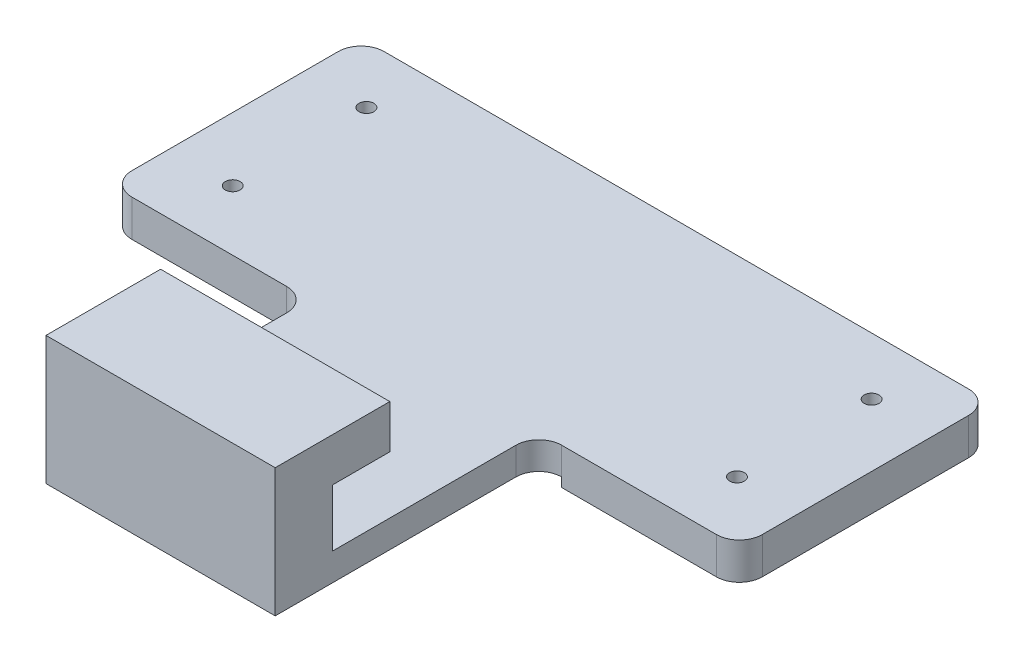
ISO-10303-21;
HEADER;
FILE_DESCRIPTION(('STEP AP214'),'2;1');
FILE_NAME('part.step','',(''),(''),'','','');
FILE_SCHEMA(('AUTOMOTIVE_DESIGN { 1 0 10303 214 1 1 1 1 }'));
ENDSEC;
DATA;
#1=APPLICATION_CONTEXT('core data for automotive mechanical design processes');
#2=APPLICATION_PROTOCOL_DEFINITION('international standard','automotive_design',2000,#1);
#3=PRODUCT_CONTEXT('',#1,'mechanical');
#4=PRODUCT('Part','Part','',(#3));
#5=PRODUCT_RELATED_PRODUCT_CATEGORY('part','',(#4));
#6=PRODUCT_DEFINITION_FORMATION('','',#4);
#7=PRODUCT_DEFINITION_CONTEXT('part definition',#1,'design');
#8=PRODUCT_DEFINITION('design','',#6,#7);
#9=PRODUCT_DEFINITION_SHAPE('','',#8);
#10=(LENGTH_UNIT() NAMED_UNIT(*) SI_UNIT(.MILLI.,.METRE.));
#11=(NAMED_UNIT(*) PLANE_ANGLE_UNIT() SI_UNIT($,.RADIAN.));
#12=(NAMED_UNIT(*) SI_UNIT($,.STERADIAN.) SOLID_ANGLE_UNIT());
#13=UNCERTAINTY_MEASURE_WITH_UNIT(LENGTH_MEASURE(1.E-05),#10,'distance_accuracy_value','');
#14=(GEOMETRIC_REPRESENTATION_CONTEXT(3) GLOBAL_UNCERTAINTY_ASSIGNED_CONTEXT((#13)) GLOBAL_UNIT_ASSIGNED_CONTEXT((#10,
#11,#12)) REPRESENTATION_CONTEXT('',''));
#15=CARTESIAN_POINT('',(0.,0.,0.));
#16=DIRECTION('',(0.,0.,1.));
#17=DIRECTION('',(1.,0.,0.));
#18=AXIS2_PLACEMENT_3D('',#15,#16,#17);
#19=CARTESIAN_POINT('',(-34.925,15.24,28.575));
#20=DIRECTION('',(0.,0.,-1.));
#21=DIRECTION('',(-1.,0.,0.));
#22=AXIS2_PLACEMENT_3D('',#19,#20,#21);
#23=PLANE('',#22);
#24=DIRECTION('',(1.,0.,0.));
#25=VECTOR('',#24,1.);
#26=CARTESIAN_POINT('',(-15.24,1.016,28.575));
#27=LINE('',#26,#25);
#28=CARTESIAN_POINT('',(-12.7,1.016,28.575));
#29=VERTEX_POINT('',#28);
#30=CARTESIAN_POINT('',(12.7,1.016,28.575));
#31=VERTEX_POINT('',#30);
#32=EDGE_CURVE('E366',#29,#31,#27,.T.);
#33=ORIENTED_EDGE('',*,*,#32,.T.);
#34=DIRECTION('',(0.,1.,0.));
#35=VECTOR('',#34,1.);
#36=CARTESIAN_POINT('',(12.7,0.,28.575));
#37=LINE('',#36,#35);
#38=CARTESIAN_POINT('',(12.7,15.24,28.575));
#39=VERTEX_POINT('',#38);
#40=EDGE_CURVE('E381',#31,#39,#37,.T.);
#41=ORIENTED_EDGE('',*,*,#40,.T.);
#42=DIRECTION('',(1.,0.,0.));
#43=VECTOR('',#42,1.);
#44=CARTESIAN_POINT('',(-34.925,15.24,28.575));
#45=LINE('',#44,#43);
#46=CARTESIAN_POINT('',(-12.7,15.24,28.575));
#47=VERTEX_POINT('',#46);
#48=EDGE_CURVE('E271',#47,#39,#45,.T.);
#49=ORIENTED_EDGE('',*,*,#48,.F.);
#50=DIRECTION('',(0.,1.,0.));
#51=VECTOR('',#50,1.);
#52=CARTESIAN_POINT('',(-12.7,0.,28.575));
#53=LINE('',#52,#51);
#54=EDGE_CURVE('E384',#29,#47,#53,.T.);
#55=ORIENTED_EDGE('',*,*,#54,.F.);
#56=EDGE_LOOP('',(#33,#41,#49,#55));
#57=FACE_BOUND('',#56,.T.);
#58=ADVANCED_FACE('F40',(#57),#23,.F.);
#59=CARTESIAN_POINT('',(0.,1.016,-4.76498919999999));
#60=DIRECTION('',(0.,0.,-1.));
#61=DIRECTION('',(-1.,0.,0.));
#62=AXIS2_PLACEMENT_3D('',#59,#60,#61);
#63=PLANE('',#62);
#64=DIRECTION('',(0.,-1.,0.));
#65=VECTOR('',#64,1.);
#66=CARTESIAN_POINT('',(-15.24,46.1888378548007,-4.76498919999999));
#67=LINE('',#66,#65);
#68=CARTESIAN_POINT('',(-15.24,1.016,-4.76498919999999));
#69=VERTEX_POINT('',#68);
#70=CARTESIAN_POINT('',(-15.24,0.,-4.76498919999999));
#71=VERTEX_POINT('',#70);
#72=EDGE_CURVE('E212',#69,#71,#67,.T.);
#73=ORIENTED_EDGE('',*,*,#72,.T.);
#74=DIRECTION('',(1.,0.,0.));
#75=VECTOR('',#74,1.);
#76=CARTESIAN_POINT('',(0.,0.,-4.76498919999999));
#77=LINE('',#76,#75);
#78=CARTESIAN_POINT('',(-30.861,0.,-4.76498919999999));
#79=VERTEX_POINT('',#78);
#80=EDGE_CURVE('E224',#79,#71,#77,.T.);
#81=ORIENTED_EDGE('',*,*,#80,.F.);
#82=DIRECTION('',(0.,-1.,0.));
#83=VECTOR('',#82,1.);
#84=CARTESIAN_POINT('',(-30.861,1.016,-4.76498919999999));
#85=LINE('',#84,#83);
#86=CARTESIAN_POINT('',(-30.861,1.016,-4.76498919999999));
#87=VERTEX_POINT('',#86);
#88=EDGE_CURVE('E250',#87,#79,#85,.T.);
#89=ORIENTED_EDGE('',*,*,#88,.F.);
#90=DIRECTION('',(1.,0.,0.));
#91=VECTOR('',#90,1.);
#92=CARTESIAN_POINT('',(0.,1.016,-4.76498919999999));
#93=LINE('',#92,#91);
#94=EDGE_CURVE('E227',#87,#69,#93,.T.);
#95=ORIENTED_EDGE('',*,*,#94,.T.);
#96=EDGE_LOOP('',(#73,#81,#89,#95));
#97=FACE_BOUND('',#96,.T.);
#98=ADVANCED_FACE('F223',(#97),#63,.T.);
#99=CARTESIAN_POINT('',(-12.7,0.,44.9679307917867));
#100=DIRECTION('',(1.,0.,0.));
#101=DIRECTION('',(0.,0.,-1.));
#102=AXIS2_PLACEMENT_3D('',#99,#100,#101);
#103=PLANE('',#102);
#104=DIRECTION('',(0.,0.,-1.));
#105=VECTOR('',#104,1.);
#106=CARTESIAN_POINT('',(-12.7,1.016,44.9679307917867));
#107=LINE('',#106,#105);
#108=CARTESIAN_POINT('',(-12.7,1.016,1.90500000000001));
#109=VERTEX_POINT('',#108);
#110=EDGE_CURVE('E54',#29,#109,#107,.T.);
#111=ORIENTED_EDGE('',*,*,#110,.F.);
#112=ORIENTED_EDGE('',*,*,#54,.T.);
#113=DIRECTION('',(0.,0.,-1.));
#114=VECTOR('',#113,1.);
#115=CARTESIAN_POINT('',(-12.7,15.24,44.9679307917867));
#116=LINE('',#115,#114);
#117=CARTESIAN_POINT('',(-12.7,15.24,15.875));
#118=VERTEX_POINT('',#117);
#119=EDGE_CURVE('E401',#47,#118,#116,.T.);
#120=ORIENTED_EDGE('',*,*,#119,.T.);
#121=DIRECTION('',(0.,-1.,0.));
#122=VECTOR('',#121,1.);
#123=CARTESIAN_POINT('',(-12.7,0.,15.875));
#124=LINE('',#123,#122);
#125=CARTESIAN_POINT('',(-12.7,10.414,15.875));
#126=VERTEX_POINT('',#125);
#127=EDGE_CURVE('E393',#118,#126,#124,.T.);
#128=ORIENTED_EDGE('',*,*,#127,.T.);
#129=DIRECTION('',(0.,0.,-1.));
#130=VECTOR('',#129,1.);
#131=CARTESIAN_POINT('',(-12.7,10.414,44.9679307917867));
#132=LINE('',#131,#130);
#133=CARTESIAN_POINT('',(-12.7,10.414,22.225));
#134=VERTEX_POINT('',#133);
#135=EDGE_CURVE('E405',#134,#126,#132,.T.);
#136=ORIENTED_EDGE('',*,*,#135,.F.);
#137=DIRECTION('',(0.,1.,0.));
#138=VECTOR('',#137,1.);
#139=CARTESIAN_POINT('',(-12.7,10.414,22.225));
#140=LINE('',#139,#138);
#141=CARTESIAN_POINT('',(-12.7,4.064,22.225));
#142=VERTEX_POINT('',#141);
#143=EDGE_CURVE('E362',#142,#134,#140,.T.);
#144=ORIENTED_EDGE('',*,*,#143,.F.);
#145=DIRECTION('',(0.,0.,1.));
#146=VECTOR('',#145,1.);
#147=CARTESIAN_POINT('',(-12.7,4.064,-28.575));
#148=LINE('',#147,#146);
#149=CARTESIAN_POINT('',(-12.7,4.064,1.90500000000001));
#150=VERTEX_POINT('',#149);
#151=EDGE_CURVE('E297',#150,#142,#148,.T.);
#152=ORIENTED_EDGE('',*,*,#151,.F.);
#153=DIRECTION('',(0.,1.,0.));
#154=VECTOR('',#153,1.);
#155=CARTESIAN_POINT('',(-12.7,0.,1.90500000000001));
#156=LINE('',#155,#154);
#157=EDGE_CURVE('E345',#150,#109,#156,.F.);
#158=ORIENTED_EDGE('',*,*,#157,.T.);
#159=EDGE_LOOP('',(#111,#112,#120,#128,#136,#144,#152,#158));
#160=FACE_BOUND('',#159,.T.);
#161=ADVANCED_FACE('F360',(#160),#103,.F.);
#162=CARTESIAN_POINT('',(12.7,0.,44.9679307917867));
#163=DIRECTION('',(1.,0.,0.));
#164=DIRECTION('',(0.,0.,-1.));
#165=AXIS2_PLACEMENT_3D('',#162,#163,#164);
#166=PLANE('',#165);
#167=ORIENTED_EDGE('',*,*,#40,.F.);
#168=DIRECTION('',(0.,0.,-1.));
#169=VECTOR('',#168,1.);
#170=CARTESIAN_POINT('',(12.7,1.016,44.9679307917867));
#171=LINE('',#170,#169);
#172=CARTESIAN_POINT('',(12.7,1.016,1.90500000000001));
#173=VERTEX_POINT('',#172);
#174=EDGE_CURVE('E378',#31,#173,#171,.T.);
#175=ORIENTED_EDGE('',*,*,#174,.T.);
#176=DIRECTION('',(0.,1.,0.));
#177=VECTOR('',#176,1.);
#178=CARTESIAN_POINT('',(12.7,0.,1.90500000000001));
#179=LINE('',#178,#177);
#180=CARTESIAN_POINT('',(12.7,4.064,1.90500000000001));
#181=VERTEX_POINT('',#180);
#182=EDGE_CURVE('E343',#173,#181,#179,.T.);
#183=ORIENTED_EDGE('',*,*,#182,.T.);
#184=DIRECTION('',(0.,0.,-1.));
#185=VECTOR('',#184,1.);
#186=CARTESIAN_POINT('',(12.7,4.064,-28.575));
#187=LINE('',#186,#185);
#188=CARTESIAN_POINT('',(12.7,4.064,22.225));
#189=VERTEX_POINT('',#188);
#190=EDGE_CURVE('E294',#189,#181,#187,.T.);
#191=ORIENTED_EDGE('',*,*,#190,.F.);
#192=DIRECTION('',(0.,-1.,0.));
#193=VECTOR('',#192,1.);
#194=CARTESIAN_POINT('',(12.7,10.414,22.225));
#195=LINE('',#194,#193);
#196=CARTESIAN_POINT('',(12.7,10.414,22.225));
#197=VERTEX_POINT('',#196);
#198=EDGE_CURVE('E387',#197,#189,#195,.T.);
#199=ORIENTED_EDGE('',*,*,#198,.F.);
#200=DIRECTION('',(0.,0.,-1.));
#201=VECTOR('',#200,1.);
#202=CARTESIAN_POINT('',(12.7,10.414,44.9679307917867));
#203=LINE('',#202,#201);
#204=CARTESIAN_POINT('',(12.7,10.414,15.875));
#205=VERTEX_POINT('',#204);
#206=EDGE_CURVE('E399',#197,#205,#203,.T.);
#207=ORIENTED_EDGE('',*,*,#206,.T.);
#208=DIRECTION('',(0.,-1.,0.));
#209=VECTOR('',#208,1.);
#210=CARTESIAN_POINT('',(12.7,0.,15.875));
#211=LINE('',#210,#209);
#212=CARTESIAN_POINT('',(12.7,15.24,15.875));
#213=VERTEX_POINT('',#212);
#214=EDGE_CURVE('E394',#213,#205,#211,.T.);
#215=ORIENTED_EDGE('',*,*,#214,.F.);
#216=DIRECTION('',(0.,0.,-1.));
#217=VECTOR('',#216,1.);
#218=CARTESIAN_POINT('',(12.7,15.24,44.9679307917867));
#219=LINE('',#218,#217);
#220=EDGE_CURVE('E398',#39,#213,#219,.T.);
#221=ORIENTED_EDGE('',*,*,#220,.F.);
#222=EDGE_LOOP('',(#167,#175,#183,#191,#199,#207,#215,#221));
#223=FACE_BOUND('',#222,.T.);
#224=ADVANCED_FACE('F466',(#223),#166,.T.);
#225=CARTESIAN_POINT('',(15.24,0.,1.90500000000001));
#226=DIRECTION('',(0.,1.,0.));
#227=DIRECTION('',(0.,0.,1.));
#228=AXIS2_PLACEMENT_3D('',#225,#226,#227);
#229=CYLINDRICAL_SURFACE('',#228,2.54);
#230=CARTESIAN_POINT('',(15.24,1.016,1.90500000000001));
#231=DIRECTION('',(0.,-1.,0.));
#232=DIRECTION('',(0.,0.,-1.));
#233=AXIS2_PLACEMENT_3D('',#230,#231,#232);
#234=CIRCLE('',#233,2.54);
#235=CARTESIAN_POINT('',(15.24,1.016,-0.634999999999989));
#236=VERTEX_POINT('',#235);
#237=EDGE_CURVE('E368',#236,#173,#234,.F.);
#238=ORIENTED_EDGE('',*,*,#237,.F.);
#239=DIRECTION('',(0.,1.,0.));
#240=VECTOR('',#239,1.);
#241=CARTESIAN_POINT('',(15.24,0.,-0.634999999999984));
#242=LINE('',#241,#240);
#243=CARTESIAN_POINT('',(15.24,4.064,-0.634999999999985));
#244=VERTEX_POINT('',#243);
#245=EDGE_CURVE('E337',#244,#236,#242,.F.);
#246=ORIENTED_EDGE('',*,*,#245,.F.);
#247=CARTESIAN_POINT('',(15.24,4.064,1.90500000000001));
#248=DIRECTION('',(0.,-1.,0.));
#249=DIRECTION('',(0.,0.,-1.));
#250=AXIS2_PLACEMENT_3D('',#247,#248,#249);
#251=CIRCLE('',#250,2.54);
#252=EDGE_CURVE('E348',#181,#244,#251,.T.);
#253=ORIENTED_EDGE('',*,*,#252,.F.);
#254=ORIENTED_EDGE('',*,*,#182,.F.);
#255=EDGE_LOOP('',(#238,#246,#253,#254));
#256=FACE_BOUND('',#255,.T.);
#257=ADVANCED_FACE('F456',(#256),#229,.F.);
#258=CARTESIAN_POINT('',(-15.24,0.,1.90500000000001));
#259=DIRECTION('',(0.,-1.,0.));
#260=DIRECTION('',(0.,0.,-1.));
#261=AXIS2_PLACEMENT_3D('',#258,#259,#260);
#262=CYLINDRICAL_SURFACE('',#261,2.54);
#263=CARTESIAN_POINT('',(-15.24,1.016,1.90500000000001));
#264=DIRECTION('',(0.,-1.,0.));
#265=DIRECTION('',(0.,0.,-1.));
#266=AXIS2_PLACEMENT_3D('',#263,#264,#265);
#267=CIRCLE('',#266,2.54);
#268=CARTESIAN_POINT('',(-15.24,1.016,-0.634999999999987));
#269=VERTEX_POINT('',#268);
#270=EDGE_CURVE('E12',#109,#269,#267,.F.);
#271=ORIENTED_EDGE('',*,*,#270,.F.);
#272=ORIENTED_EDGE('',*,*,#157,.F.);
#273=CARTESIAN_POINT('',(-15.24,4.064,1.90500000000001));
#274=DIRECTION('',(0.,-1.,0.));
#275=DIRECTION('',(0.,0.,-1.));
#276=AXIS2_PLACEMENT_3D('',#273,#274,#275);
#277=CIRCLE('',#276,2.54);
#278=CARTESIAN_POINT('',(-15.24,4.064,-0.634999999999986));
#279=VERTEX_POINT('',#278);
#280=EDGE_CURVE('E48',#279,#150,#277,.T.);
#281=ORIENTED_EDGE('',*,*,#280,.F.);
#282=DIRECTION('',(0.,1.,0.));
#283=VECTOR('',#282,1.);
#284=CARTESIAN_POINT('',(-15.24,4.064,-0.634999999999986));
#285=LINE('',#284,#283);
#286=EDGE_CURVE('E316',#269,#279,#285,.T.);
#287=ORIENTED_EDGE('',*,*,#286,.F.);
#288=EDGE_LOOP('',(#271,#272,#281,#287));
#289=FACE_BOUND('',#288,.T.);
#290=ADVANCED_FACE('F42',(#289),#262,.F.);
#291=CARTESIAN_POINT('',(15.875,15.24,15.875));
#292=DIRECTION('',(0.,0.,1.));
#293=DIRECTION('',(1.,0.,0.));
#294=AXIS2_PLACEMENT_3D('',#291,#292,#293);
#295=PLANE('',#294);
#296=ORIENTED_EDGE('',*,*,#214,.T.);
#297=DIRECTION('',(-1.,0.,0.));
#298=VECTOR('',#297,1.);
#299=CARTESIAN_POINT('',(34.925,10.414,15.875));
#300=LINE('',#299,#298);
#301=EDGE_CURVE('E409',#205,#126,#300,.T.);
#302=ORIENTED_EDGE('',*,*,#301,.T.);
#303=ORIENTED_EDGE('',*,*,#127,.F.);
#304=DIRECTION('',(-1.,0.,0.));
#305=VECTOR('',#304,1.);
#306=CARTESIAN_POINT('',(15.875,15.24,15.875));
#307=LINE('',#306,#305);
#308=EDGE_CURVE('E247',#213,#118,#307,.T.);
#309=ORIENTED_EDGE('',*,*,#308,.F.);
#310=EDGE_LOOP('',(#296,#302,#303,#309));
#311=FACE_BOUND('',#310,.T.);
#312=ADVANCED_FACE('F477',(#311),#295,.F.);
#313=CARTESIAN_POINT('',(34.925,10.414,15.875));
#314=DIRECTION('',(0.,1.,0.));
#315=DIRECTION('',(0.,0.,1.));
#316=AXIS2_PLACEMENT_3D('',#313,#314,#315);
#317=PLANE('',#316);
#318=ORIENTED_EDGE('',*,*,#206,.F.);
#319=DIRECTION('',(-1.,0.,0.));
#320=VECTOR('',#319,1.);
#321=CARTESIAN_POINT('',(34.925,10.414,22.225));
#322=LINE('',#321,#320);
#323=EDGE_CURVE('E397',#197,#134,#322,.T.);
#324=ORIENTED_EDGE('',*,*,#323,.T.);
#325=ORIENTED_EDGE('',*,*,#135,.T.);
#326=ORIENTED_EDGE('',*,*,#301,.F.);
#327=EDGE_LOOP('',(#318,#324,#325,#326));
#328=FACE_BOUND('',#327,.T.);
#329=ADVANCED_FACE('F472',(#328),#317,.F.);
#330=CARTESIAN_POINT('',(86.1203367016958,10.414,22.225));
#331=DIRECTION('',(0.,0.,1.));
#332=DIRECTION('',(1.,0.,0.));
#333=AXIS2_PLACEMENT_3D('',#330,#331,#332);
#334=PLANE('',#333);
#335=DIRECTION('',(-1.,0.,0.));
#336=VECTOR('',#335,1.);
#337=CARTESIAN_POINT('',(86.1203367016958,4.064,22.225));
#338=LINE('',#337,#336);
#339=EDGE_CURVE('E262',#189,#142,#338,.T.);
#340=ORIENTED_EDGE('',*,*,#339,.T.);
#341=ORIENTED_EDGE('',*,*,#143,.T.);
#342=ORIENTED_EDGE('',*,*,#323,.F.);
#343=ORIENTED_EDGE('',*,*,#198,.T.);
#344=EDGE_LOOP('',(#340,#341,#342,#343));
#345=FACE_BOUND('',#344,.T.);
#346=ADVANCED_FACE('F470',(#345),#334,.F.);
#347=CARTESIAN_POINT('',(0.,0.,0.));
#348=DIRECTION('',(0.,-1.,0.));
#349=DIRECTION('',(0.,0.,-1.));
#350=AXIS2_PLACEMENT_3D('',#347,#348,#349);
#351=PLANE('',#350);
#352=DIRECTION('',(0.,0.,-1.));
#353=VECTOR('',#352,1.);
#354=CARTESIAN_POINT('',(-15.24,0.,28.575));
#355=LINE('',#354,#353);
#356=CARTESIAN_POINT('',(-15.24,0.,-0.634999999999987));
#357=VERTEX_POINT('',#356);
#358=EDGE_CURVE('E208',#357,#71,#355,.T.);
#359=ORIENTED_EDGE('',*,*,#358,.F.);
#360=DIRECTION('',(-1.,0.,0.));
#361=VECTOR('',#360,1.);
#362=CARTESIAN_POINT('',(-34.925,0.,-0.634999999999986));
#363=LINE('',#362,#361);
#364=CARTESIAN_POINT('',(-32.385,0.,-0.634999999999986));
#365=VERTEX_POINT('',#364);
#366=EDGE_CURVE('E382',#357,#365,#363,.T.);
#367=ORIENTED_EDGE('',*,*,#366,.T.);
#368=CARTESIAN_POINT('',(-32.385,0.,-3.17499999999998));
#369=DIRECTION('',(0.,-1.,0.));
#370=DIRECTION('',(0.,0.,-1.));
#371=AXIS2_PLACEMENT_3D('',#368,#369,#370);
#372=CIRCLE('',#371,2.54);
#373=CARTESIAN_POINT('',(-34.925,0.,-3.17499999999998));
#374=VERTEX_POINT('',#373);
#375=EDGE_CURVE('E325',#365,#374,#372,.T.);
#376=ORIENTED_EDGE('',*,*,#375,.T.);
#377=DIRECTION('',(0.,0.,1.));
#378=VECTOR('',#377,1.);
#379=CARTESIAN_POINT('',(-34.925,0.,28.575));
#380=LINE('',#379,#378);
#381=CARTESIAN_POINT('',(-34.925,0.,-26.035));
#382=VERTEX_POINT('',#381);
#383=EDGE_CURVE('E275',#382,#374,#380,.T.);
#384=ORIENTED_EDGE('',*,*,#383,.F.);
#385=CARTESIAN_POINT('',(-32.385,0.,-26.035));
#386=DIRECTION('',(0.,-1.,0.));
#387=DIRECTION('',(0.,0.,-1.));
#388=AXIS2_PLACEMENT_3D('',#385,#386,#387);
#389=CIRCLE('',#388,2.54);
#390=CARTESIAN_POINT('',(-32.385,0.,-28.575));
#391=VERTEX_POINT('',#390);
#392=EDGE_CURVE('E323',#382,#391,#389,.T.);
#393=ORIENTED_EDGE('',*,*,#392,.T.);
#394=DIRECTION('',(-1.,0.,0.));
#395=VECTOR('',#394,1.);
#396=CARTESIAN_POINT('',(-34.925,0.,-28.575));
#397=LINE('',#396,#395);
#398=CARTESIAN_POINT('',(32.385,0.,-28.575));
#399=VERTEX_POINT('',#398);
#400=EDGE_CURVE('E278',#399,#391,#397,.T.);
#401=ORIENTED_EDGE('',*,*,#400,.F.);
#402=CARTESIAN_POINT('',(32.385,0.,-26.035));
#403=DIRECTION('',(0.,-1.,0.));
#404=DIRECTION('',(0.,0.,-1.));
#405=AXIS2_PLACEMENT_3D('',#402,#403,#404);
#406=CIRCLE('',#405,2.54);
#407=CARTESIAN_POINT('',(34.925,0.,-26.035));
#408=VERTEX_POINT('',#407);
#409=EDGE_CURVE('E321',#399,#408,#406,.T.);
#410=ORIENTED_EDGE('',*,*,#409,.T.);
#411=DIRECTION('',(0.,0.,-1.));
#412=VECTOR('',#411,1.);
#413=CARTESIAN_POINT('',(34.925,0.,28.575));
#414=LINE('',#413,#412);
#415=CARTESIAN_POINT('',(34.925,0.,-3.17499999999998));
#416=VERTEX_POINT('',#415);
#417=EDGE_CURVE('E270',#416,#408,#414,.T.);
#418=ORIENTED_EDGE('',*,*,#417,.F.);
#419=CARTESIAN_POINT('',(32.385,0.,-3.17499999999999));
#420=DIRECTION('',(0.,-1.,0.));
#421=DIRECTION('',(0.,0.,-1.));
#422=AXIS2_PLACEMENT_3D('',#419,#420,#421);
#423=CIRCLE('',#422,2.54);
#424=CARTESIAN_POINT('',(32.385,0.,-0.634999999999986));
#425=VERTEX_POINT('',#424);
#426=EDGE_CURVE('E62',#416,#425,#423,.T.);
#427=ORIENTED_EDGE('',*,*,#426,.T.);
#428=DIRECTION('',(-1.,0.,0.));
#429=VECTOR('',#428,1.);
#430=CARTESIAN_POINT('',(34.925,0.,-0.634999999999986));
#431=LINE('',#430,#429);
#432=CARTESIAN_POINT('',(15.24,0.,-0.634999999999989));
#433=VERTEX_POINT('',#432);
#434=EDGE_CURVE('E385',#425,#433,#431,.T.);
#435=ORIENTED_EDGE('',*,*,#434,.T.);
#436=DIRECTION('',(0.,0.,1.));
#437=VECTOR('',#436,1.);
#438=CARTESIAN_POINT('',(15.24,0.,28.575));
#439=LINE('',#438,#437);
#440=CARTESIAN_POINT('',(15.24,0.,-4.76498919999999));
#441=VERTEX_POINT('',#440);
#442=EDGE_CURVE('E219',#441,#433,#439,.T.);
#443=ORIENTED_EDGE('',*,*,#442,.F.);
#444=CARTESIAN_POINT('',(30.861,0.,-4.76498919999999));
#445=VERTEX_POINT('',#444);
#446=EDGE_CURVE('E234',#441,#445,#77,.T.);
#447=ORIENTED_EDGE('',*,*,#446,.T.);
#448=DIRECTION('',(0.,0.,-1.));
#449=VECTOR('',#448,1.);
#450=CARTESIAN_POINT('',(30.861,0.,0.));
#451=LINE('',#450,#449);
#452=CARTESIAN_POINT('',(30.861,0.,-24.765));
#453=VERTEX_POINT('',#452);
#454=EDGE_CURVE('E238',#445,#453,#451,.T.);
#455=ORIENTED_EDGE('',*,*,#454,.T.);
#456=DIRECTION('',(1.,0.,0.));
#457=VECTOR('',#456,1.);
#458=CARTESIAN_POINT('',(0.,0.,-24.765));
#459=LINE('',#458,#457);
#460=CARTESIAN_POINT('',(-30.861,0.,-24.765));
#461=VERTEX_POINT('',#460);
#462=EDGE_CURVE('E236',#461,#453,#459,.T.);
#463=ORIENTED_EDGE('',*,*,#462,.F.);
#464=DIRECTION('',(0.,0.,-1.));
#465=VECTOR('',#464,1.);
#466=CARTESIAN_POINT('',(-30.861,0.,0.));
#467=LINE('',#466,#465);
#468=EDGE_CURVE('E233',#79,#461,#467,.T.);
#469=ORIENTED_EDGE('',*,*,#468,.F.);
#470=ORIENTED_EDGE('',*,*,#80,.T.);
#471=EDGE_LOOP('',(#359,#367,#376,#384,#393,#401,#410,#418,#427,#435,#443,#447,#455,#463,#469,#470));
#472=FACE_BOUND('',#471,.T.);
#473=ADVANCED_FACE('F230',(#472),#351,.T.);
#474=CARTESIAN_POINT('',(34.925,15.24,28.575));
#475=DIRECTION('',(-1.,0.,0.));
#476=DIRECTION('',(0.,0.,1.));
#477=AXIS2_PLACEMENT_3D('',#474,#475,#476);
#478=PLANE('',#477);
#479=ORIENTED_EDGE('',*,*,#417,.T.);
#480=DIRECTION('',(0.,-1.,0.));
#481=VECTOR('',#480,1.);
#482=CARTESIAN_POINT('',(34.925,15.24,-26.035));
#483=LINE('',#482,#481);
#484=CARTESIAN_POINT('',(34.925,4.064,-26.035));
#485=VERTEX_POINT('',#484);
#486=EDGE_CURVE('E334',#408,#485,#483,.F.);
#487=ORIENTED_EDGE('',*,*,#486,.T.);
#488=DIRECTION('',(0.,0.,-1.));
#489=VECTOR('',#488,1.);
#490=CARTESIAN_POINT('',(34.925,4.064,-28.575));
#491=LINE('',#490,#489);
#492=CARTESIAN_POINT('',(34.925,4.064,-3.17499999999999));
#493=VERTEX_POINT('',#492);
#494=EDGE_CURVE('E265',#493,#485,#491,.T.);
#495=ORIENTED_EDGE('',*,*,#494,.F.);
#496=DIRECTION('',(0.,1.,0.));
#497=VECTOR('',#496,1.);
#498=CARTESIAN_POINT('',(34.925,15.24,-3.17499999999998));
#499=LINE('',#498,#497);
#500=EDGE_CURVE('E332',#493,#416,#499,.F.);
#501=ORIENTED_EDGE('',*,*,#500,.T.);
#502=EDGE_LOOP('',(#479,#487,#495,#501));
#503=FACE_BOUND('',#502,.T.);
#504=ADVANCED_FACE('F502',(#503),#478,.F.);
#505=CARTESIAN_POINT('',(0.,15.24,0.));
#506=DIRECTION('',(0.,-1.,0.));
#507=DIRECTION('',(0.,0.,-1.));
#508=AXIS2_PLACEMENT_3D('',#505,#506,#507);
#509=PLANE('',#508);
#510=ORIENTED_EDGE('',*,*,#119,.F.);
#511=ORIENTED_EDGE('',*,*,#48,.T.);
#512=ORIENTED_EDGE('',*,*,#220,.T.);
#513=ORIENTED_EDGE('',*,*,#308,.T.);
#514=EDGE_LOOP('',(#510,#511,#512,#513));
#515=FACE_BOUND('',#514,.T.);
#516=ADVANCED_FACE('F481',(#515),#509,.F.);
#517=CARTESIAN_POINT('',(-34.925,15.24,-28.575));
#518=DIRECTION('',(0.,0.,1.));
#519=DIRECTION('',(1.,0.,0.));
#520=AXIS2_PLACEMENT_3D('',#517,#518,#519);
#521=PLANE('',#520);
#522=ORIENTED_EDGE('',*,*,#400,.T.);
#523=DIRECTION('',(0.,-1.,0.));
#524=VECTOR('',#523,1.);
#525=CARTESIAN_POINT('',(-32.385,15.24,-28.575));
#526=LINE('',#525,#524);
#527=CARTESIAN_POINT('',(-32.385,4.064,-28.575));
#528=VERTEX_POINT('',#527);
#529=EDGE_CURVE('E330',#391,#528,#526,.F.);
#530=ORIENTED_EDGE('',*,*,#529,.T.);
#531=DIRECTION('',(-1.,0.,0.));
#532=VECTOR('',#531,1.);
#533=CARTESIAN_POINT('',(86.1203367016958,4.064,-28.575));
#534=LINE('',#533,#532);
#535=CARTESIAN_POINT('',(32.385,4.064,-28.575));
#536=VERTEX_POINT('',#535);
#537=EDGE_CURVE('E261',#536,#528,#534,.T.);
#538=ORIENTED_EDGE('',*,*,#537,.F.);
#539=DIRECTION('',(0.,-1.,0.));
#540=VECTOR('',#539,1.);
#541=CARTESIAN_POINT('',(32.385,15.24,-28.575));
#542=LINE('',#541,#540);
#543=EDGE_CURVE('E327',#536,#399,#542,.T.);
#544=ORIENTED_EDGE('',*,*,#543,.T.);
#545=EDGE_LOOP('',(#522,#530,#538,#544));
#546=FACE_BOUND('',#545,.T.);
#547=ADVANCED_FACE('F497',(#546),#521,.F.);
#548=CARTESIAN_POINT('',(-34.925,15.24,28.575));
#549=DIRECTION('',(1.,0.,0.));
#550=DIRECTION('',(0.,0.,-1.));
#551=AXIS2_PLACEMENT_3D('',#548,#549,#550);
#552=PLANE('',#551);
#553=ORIENTED_EDGE('',*,*,#383,.T.);
#554=DIRECTION('',(0.,1.,0.));
#555=VECTOR('',#554,1.);
#556=CARTESIAN_POINT('',(-34.925,15.24,-3.17499999999998));
#557=LINE('',#556,#555);
#558=CARTESIAN_POINT('',(-34.925,4.064,-3.17499999999998));
#559=VERTEX_POINT('',#558);
#560=EDGE_CURVE('E305',#374,#559,#557,.T.);
#561=ORIENTED_EDGE('',*,*,#560,.T.);
#562=DIRECTION('',(0.,0.,1.));
#563=VECTOR('',#562,1.);
#564=CARTESIAN_POINT('',(-34.925,4.064,-28.575));
#565=LINE('',#564,#563);
#566=CARTESIAN_POINT('',(-34.925,4.064,-26.035));
#567=VERTEX_POINT('',#566);
#568=EDGE_CURVE('E258',#567,#559,#565,.T.);
#569=ORIENTED_EDGE('',*,*,#568,.F.);
#570=DIRECTION('',(0.,-1.,0.));
#571=VECTOR('',#570,1.);
#572=CARTESIAN_POINT('',(-34.925,15.24,-26.035));
#573=LINE('',#572,#571);
#574=EDGE_CURVE('E302',#567,#382,#573,.T.);
#575=ORIENTED_EDGE('',*,*,#574,.T.);
#576=EDGE_LOOP('',(#553,#561,#569,#575));
#577=FACE_BOUND('',#576,.T.);
#578=ADVANCED_FACE('F494',(#577),#552,.F.);
#579=CARTESIAN_POINT('',(86.1203367016958,4.064,-28.575));
#580=DIRECTION('',(0.,-1.,0.));
#581=DIRECTION('',(0.,0.,-1.));
#582=AXIS2_PLACEMENT_3D('',#579,#580,#581);
#583=PLANE('',#582);
#584=CARTESIAN_POINT('',(27.9908,4.064,-22.225));
#585=DIRECTION('',(0.,-1.,0.));
#586=DIRECTION('',(0.,0.,-1.));
#587=AXIS2_PLACEMENT_3D('',#584,#585,#586);
#588=CIRCLE('',#587,0.819150000000002);
#589=CARTESIAN_POINT('',(27.9908,4.064,-23.04415));
#590=VERTEX_POINT('',#589);
#591=EDGE_CURVE('E291',#590,#590,#588,.T.);
#592=ORIENTED_EDGE('',*,*,#591,.T.);
#593=EDGE_LOOP('',(#592));
#594=FACE_BOUND('',#593,.T.);
#595=CARTESIAN_POINT('',(-27.8892,4.064,-7.30498919999999));
#596=DIRECTION('',(0.,-1.,0.));
#597=DIRECTION('',(0.,0.,-1.));
#598=AXIS2_PLACEMENT_3D('',#595,#596,#597);
#599=CIRCLE('',#598,0.819149999999995);
#600=CARTESIAN_POINT('',(-27.8892,4.064,-8.12413919999998));
#601=VERTEX_POINT('',#600);
#602=EDGE_CURVE('E417',#601,#601,#599,.T.);
#603=ORIENTED_EDGE('',*,*,#602,.T.);
#604=EDGE_LOOP('',(#603));
#605=FACE_BOUND('',#604,.T.);
#606=CARTESIAN_POINT('',(27.9908,4.064,-7.30498919999999));
#607=DIRECTION('',(0.,-1.,0.));
#608=DIRECTION('',(0.,0.,-1.));
#609=AXIS2_PLACEMENT_3D('',#606,#607,#608);
#610=CIRCLE('',#609,0.819150000000002);
#611=CARTESIAN_POINT('',(27.9908,4.064,-8.12413919999999));
#612=VERTEX_POINT('',#611);
#613=EDGE_CURVE('E287',#612,#612,#610,.T.);
#614=ORIENTED_EDGE('',*,*,#613,.T.);
#615=EDGE_LOOP('',(#614));
#616=FACE_BOUND('',#615,.T.);
#617=CARTESIAN_POINT('',(-27.9908,4.064,-22.225));
#618=DIRECTION('',(0.,-1.,0.));
#619=DIRECTION('',(0.,0.,-1.));
#620=AXIS2_PLACEMENT_3D('',#617,#618,#619);
#621=CIRCLE('',#620,0.819150000000002);
#622=CARTESIAN_POINT('',(-27.9908,4.064,-23.04415));
#623=VERTEX_POINT('',#622);
#624=EDGE_CURVE('E286',#623,#623,#621,.T.);
#625=ORIENTED_EDGE('',*,*,#624,.T.);
#626=EDGE_LOOP('',(#625));
#627=FACE_BOUND('',#626,.T.);
#628=ORIENTED_EDGE('',*,*,#568,.T.);
#629=CARTESIAN_POINT('',(-32.385,4.064,-3.17499999999998));
#630=DIRECTION('',(0.,-1.,0.));
#631=DIRECTION('',(0.,0.,-1.));
#632=AXIS2_PLACEMENT_3D('',#629,#630,#631);
#633=CIRCLE('',#632,2.54);
#634=CARTESIAN_POINT('',(-32.385,4.064,-0.634999999999986));
#635=VERTEX_POINT('',#634);
#636=EDGE_CURVE('E314',#559,#635,#633,.F.);
#637=ORIENTED_EDGE('',*,*,#636,.T.);
#638=DIRECTION('',(1.,0.,0.));
#639=VECTOR('',#638,1.);
#640=CARTESIAN_POINT('',(86.1203367016958,4.064,-0.634999999999986));
#641=LINE('',#640,#639);
#642=EDGE_CURVE('E299',#635,#279,#641,.T.);
#643=ORIENTED_EDGE('',*,*,#642,.T.);
#644=ORIENTED_EDGE('',*,*,#280,.T.);
#645=ORIENTED_EDGE('',*,*,#151,.T.);
#646=ORIENTED_EDGE('',*,*,#339,.F.);
#647=ORIENTED_EDGE('',*,*,#190,.T.);
#648=ORIENTED_EDGE('',*,*,#252,.T.);
#649=DIRECTION('',(1.,0.,0.));
#650=VECTOR('',#649,1.);
#651=CARTESIAN_POINT('',(86.1203367016958,4.064,-0.634999999999993));
#652=LINE('',#651,#650);
#653=CARTESIAN_POINT('',(32.385,4.064,-0.634999999999987));
#654=VERTEX_POINT('',#653);
#655=EDGE_CURVE('E274',#244,#654,#652,.T.);
#656=ORIENTED_EDGE('',*,*,#655,.T.);
#657=CARTESIAN_POINT('',(32.385,4.064,-3.17499999999999));
#658=DIRECTION('',(0.,-1.,0.));
#659=DIRECTION('',(0.,0.,-1.));
#660=AXIS2_PLACEMENT_3D('',#657,#658,#659);
#661=CIRCLE('',#660,2.54);
#662=EDGE_CURVE('E308',#654,#493,#661,.F.);
#663=ORIENTED_EDGE('',*,*,#662,.T.);
#664=ORIENTED_EDGE('',*,*,#494,.T.);
#665=CARTESIAN_POINT('',(32.385,4.064,-26.035));
#666=DIRECTION('',(0.,-1.,0.));
#667=DIRECTION('',(0.,0.,-1.));
#668=AXIS2_PLACEMENT_3D('',#665,#666,#667);
#669=CIRCLE('',#668,2.54);
#670=EDGE_CURVE('E310',#485,#536,#669,.F.);
#671=ORIENTED_EDGE('',*,*,#670,.T.);
#672=ORIENTED_EDGE('',*,*,#537,.T.);
#673=CARTESIAN_POINT('',(-32.385,4.064,-26.035));
#674=DIRECTION('',(0.,-1.,0.));
#675=DIRECTION('',(0.,0.,-1.));
#676=AXIS2_PLACEMENT_3D('',#673,#674,#675);
#677=CIRCLE('',#676,2.54);
#678=EDGE_CURVE('E312',#528,#567,#677,.F.);
#679=ORIENTED_EDGE('',*,*,#678,.T.);
#680=EDGE_LOOP('',(#628,#637,#643,#644,#645,#646,#647,#648,#656,#663,#664,#671,#672,#679));
#681=FACE_BOUND('',#680,.T.);
#682=ADVANCED_FACE('F352',(#594,#605,#616,#627,#681),#583,.F.);
#683=CARTESIAN_POINT('',(30.861,1.016,0.));
#684=DIRECTION('',(-1.,0.,0.));
#685=DIRECTION('',(0.,0.,1.));
#686=AXIS2_PLACEMENT_3D('',#683,#684,#685);
#687=PLANE('',#686);
#688=ORIENTED_EDGE('',*,*,#454,.F.);
#689=DIRECTION('',(0.,-1.,0.));
#690=VECTOR('',#689,1.);
#691=CARTESIAN_POINT('',(30.861,1.016,-4.76498919999999));
#692=LINE('',#691,#690);
#693=CARTESIAN_POINT('',(30.861,1.016,-4.76498919999999));
#694=VERTEX_POINT('',#693);
#695=EDGE_CURVE('E252',#694,#445,#692,.T.);
#696=ORIENTED_EDGE('',*,*,#695,.F.);
#697=DIRECTION('',(0.,0.,-1.));
#698=VECTOR('',#697,1.);
#699=CARTESIAN_POINT('',(30.861,1.016,0.));
#700=LINE('',#699,#698);
#701=CARTESIAN_POINT('',(30.861,1.016,-24.765));
#702=VERTEX_POINT('',#701);
#703=EDGE_CURVE('E244',#694,#702,#700,.T.);
#704=ORIENTED_EDGE('',*,*,#703,.T.);
#705=DIRECTION('',(0.,-1.,0.));
#706=VECTOR('',#705,1.);
#707=CARTESIAN_POINT('',(30.861,1.016,-24.765));
#708=LINE('',#707,#706);
#709=EDGE_CURVE('E245',#702,#453,#708,.T.);
#710=ORIENTED_EDGE('',*,*,#709,.T.);
#711=EDGE_LOOP('',(#688,#696,#704,#710));
#712=FACE_BOUND('',#711,.T.);
#713=ADVANCED_FACE('F444',(#712),#687,.T.);
#714=CARTESIAN_POINT('',(0.,1.016,-24.765));
#715=DIRECTION('',(0.,0.,-1.));
#716=DIRECTION('',(-1.,0.,0.));
#717=AXIS2_PLACEMENT_3D('',#714,#715,#716);
#718=PLANE('',#717);
#719=ORIENTED_EDGE('',*,*,#462,.T.);
#720=ORIENTED_EDGE('',*,*,#709,.F.);
#721=DIRECTION('',(1.,0.,0.));
#722=VECTOR('',#721,1.);
#723=CARTESIAN_POINT('',(0.,1.016,-24.765));
#724=LINE('',#723,#722);
#725=CARTESIAN_POINT('',(-30.861,1.016,-24.765));
#726=VERTEX_POINT('',#725);
#727=EDGE_CURVE('E255',#726,#702,#724,.T.);
#728=ORIENTED_EDGE('',*,*,#727,.F.);
#729=DIRECTION('',(0.,-1.,0.));
#730=VECTOR('',#729,1.);
#731=CARTESIAN_POINT('',(-30.861,1.016,-24.765));
#732=LINE('',#731,#730);
#733=EDGE_CURVE('E248',#726,#461,#732,.T.);
#734=ORIENTED_EDGE('',*,*,#733,.T.);
#735=EDGE_LOOP('',(#719,#720,#728,#734));
#736=FACE_BOUND('',#735,.T.);
#737=ADVANCED_FACE('F440',(#736),#718,.F.);
#738=CARTESIAN_POINT('',(-30.861,1.016,0.));
#739=DIRECTION('',(-1.,0.,0.));
#740=DIRECTION('',(0.,0.,1.));
#741=AXIS2_PLACEMENT_3D('',#738,#739,#740);
#742=PLANE('',#741);
#743=ORIENTED_EDGE('',*,*,#468,.T.);
#744=ORIENTED_EDGE('',*,*,#733,.F.);
#745=DIRECTION('',(0.,0.,-1.));
#746=VECTOR('',#745,1.);
#747=CARTESIAN_POINT('',(-30.861,1.016,0.));
#748=LINE('',#747,#746);
#749=EDGE_CURVE('E432',#87,#726,#748,.T.);
#750=ORIENTED_EDGE('',*,*,#749,.F.);
#751=ORIENTED_EDGE('',*,*,#88,.T.);
#752=EDGE_LOOP('',(#743,#744,#750,#751));
#753=FACE_BOUND('',#752,.T.);
#754=ADVANCED_FACE('F559',(#753),#742,.F.);
#755=DIRECTION('',(0.,-1.,0.));
#756=VECTOR('',#755,1.);
#757=CARTESIAN_POINT('',(15.24,46.1888378548007,-4.76498919999999));
#758=LINE('',#757,#756);
#759=CARTESIAN_POINT('',(15.24,1.016,-4.76498919999999));
#760=VERTEX_POINT('',#759);
#761=EDGE_CURVE('E228',#760,#441,#758,.T.);
#762=ORIENTED_EDGE('',*,*,#761,.F.);
#763=EDGE_CURVE('E430',#760,#694,#93,.T.);
#764=ORIENTED_EDGE('',*,*,#763,.T.);
#765=ORIENTED_EDGE('',*,*,#695,.T.);
#766=ORIENTED_EDGE('',*,*,#446,.F.);
#767=EDGE_LOOP('',(#762,#764,#765,#766));
#768=FACE_BOUND('',#767,.T.);
#769=ADVANCED_FACE('F449',(#768),#63,.T.);
#770=CARTESIAN_POINT('',(0.,1.016,0.));
#771=DIRECTION('',(0.,-1.,0.));
#772=DIRECTION('',(0.,0.,-1.));
#773=AXIS2_PLACEMENT_3D('',#770,#771,#772);
#774=PLANE('',#773);
#775=CARTESIAN_POINT('',(27.9908,1.016,-22.225));
#776=DIRECTION('',(0.,-1.,0.));
#777=DIRECTION('',(0.,0.,-1.));
#778=AXIS2_PLACEMENT_3D('',#775,#776,#777);
#779=CIRCLE('',#778,0.819150000000002);
#780=CARTESIAN_POINT('',(27.9908,1.016,-23.04415));
#781=VERTEX_POINT('',#780);
#782=EDGE_CURVE('E288',#781,#781,#779,.T.);
#783=ORIENTED_EDGE('',*,*,#782,.F.);
#784=EDGE_LOOP('',(#783));
#785=FACE_BOUND('',#784,.T.);
#786=CARTESIAN_POINT('',(-27.9908,1.016,-22.225));
#787=DIRECTION('',(0.,-1.,0.));
#788=DIRECTION('',(0.,0.,-1.));
#789=AXIS2_PLACEMENT_3D('',#786,#787,#788);
#790=CIRCLE('',#789,0.819150000000002);
#791=CARTESIAN_POINT('',(-27.9908,1.016,-23.04415));
#792=VERTEX_POINT('',#791);
#793=EDGE_CURVE('E283',#792,#792,#790,.T.);
#794=ORIENTED_EDGE('',*,*,#793,.F.);
#795=EDGE_LOOP('',(#794));
#796=FACE_BOUND('',#795,.T.);
#797=CARTESIAN_POINT('',(27.9908,1.016,-7.30498919999999));
#798=DIRECTION('',(0.,-1.,0.));
#799=DIRECTION('',(0.,0.,-1.));
#800=AXIS2_PLACEMENT_3D('',#797,#798,#799);
#801=CIRCLE('',#800,0.819150000000002);
#802=CARTESIAN_POINT('',(27.9908,1.016,-8.12413919999999));
#803=VERTEX_POINT('',#802);
#804=EDGE_CURVE('E420',#803,#803,#801,.T.);
#805=ORIENTED_EDGE('',*,*,#804,.F.);
#806=EDGE_LOOP('',(#805));
#807=FACE_BOUND('',#806,.T.);
#808=CARTESIAN_POINT('',(-27.8892,1.016,-7.30498919999999));
#809=DIRECTION('',(0.,-1.,0.));
#810=DIRECTION('',(0.,0.,-1.));
#811=AXIS2_PLACEMENT_3D('',#808,#809,#810);
#812=CIRCLE('',#811,0.819149999999995);
#813=CARTESIAN_POINT('',(-27.8892,1.016,-8.12413919999998));
#814=VERTEX_POINT('',#813);
#815=EDGE_CURVE('E412',#814,#814,#812,.T.);
#816=ORIENTED_EDGE('',*,*,#815,.F.);
#817=EDGE_LOOP('',(#816));
#818=FACE_BOUND('',#817,.T.);
#819=ORIENTED_EDGE('',*,*,#703,.F.);
#820=ORIENTED_EDGE('',*,*,#763,.F.);
#821=DIRECTION('',(0.,0.,-1.));
#822=VECTOR('',#821,1.);
#823=CARTESIAN_POINT('',(15.24,1.016,28.575));
#824=LINE('',#823,#822);
#825=EDGE_CURVE('E371',#236,#760,#824,.T.);
#826=ORIENTED_EDGE('',*,*,#825,.F.);
#827=ORIENTED_EDGE('',*,*,#237,.T.);
#828=ORIENTED_EDGE('',*,*,#174,.F.);
#829=ORIENTED_EDGE('',*,*,#32,.F.);
#830=ORIENTED_EDGE('',*,*,#110,.T.);
#831=ORIENTED_EDGE('',*,*,#270,.T.);
#832=DIRECTION('',(0.,0.,1.));
#833=VECTOR('',#832,1.);
#834=CARTESIAN_POINT('',(-15.24,1.016,28.575));
#835=LINE('',#834,#833);
#836=EDGE_CURVE('E365',#69,#269,#835,.T.);
#837=ORIENTED_EDGE('',*,*,#836,.F.);
#838=ORIENTED_EDGE('',*,*,#94,.F.);
#839=ORIENTED_EDGE('',*,*,#749,.T.);
#840=ORIENTED_EDGE('',*,*,#727,.T.);
#841=EDGE_LOOP('',(#819,#820,#826,#827,#828,#829,#830,#831,#837,#838,#839,#840));
#842=FACE_BOUND('',#841,.T.);
#843=ADVANCED_FACE('F364',(#785,#796,#807,#818,#842),#774,.T.);
#844=CARTESIAN_POINT('',(-27.9908,15.24,-22.225));
#845=DIRECTION('',(0.,-1.,0.));
#846=DIRECTION('',(0.,0.,-1.));
#847=AXIS2_PLACEMENT_3D('',#844,#845,#846);
#848=CYLINDRICAL_SURFACE('',#847,0.819150000000002);
#849=ORIENTED_EDGE('',*,*,#793,.T.);
#850=EDGE_LOOP('',(#849));
#851=FACE_BOUND('',#850,.T.);
#852=ORIENTED_EDGE('',*,*,#624,.F.);
#853=EDGE_LOOP('',(#852));
#854=FACE_BOUND('',#853,.T.);
#855=ADVANCED_FACE('F542',(#851,#854),#848,.F.);
#856=CARTESIAN_POINT('',(27.9908,15.24,-7.30498919999999));
#857=DIRECTION('',(0.,-1.,0.));
#858=DIRECTION('',(0.,0.,-1.));
#859=AXIS2_PLACEMENT_3D('',#856,#857,#858);
#860=CYLINDRICAL_SURFACE('',#859,0.819150000000002);
#861=ORIENTED_EDGE('',*,*,#804,.T.);
#862=EDGE_LOOP('',(#861));
#863=FACE_BOUND('',#862,.T.);
#864=ORIENTED_EDGE('',*,*,#613,.F.);
#865=EDGE_LOOP('',(#864));
#866=FACE_BOUND('',#865,.T.);
#867=ADVANCED_FACE('F538',(#863,#866),#860,.F.);
#868=CARTESIAN_POINT('',(-27.8892,15.24,-7.30498919999999));
#869=DIRECTION('',(0.,-1.,0.));
#870=DIRECTION('',(0.,0.,-1.));
#871=AXIS2_PLACEMENT_3D('',#868,#869,#870);
#872=CYLINDRICAL_SURFACE('',#871,0.819149999999995);
#873=ORIENTED_EDGE('',*,*,#815,.T.);
#874=EDGE_LOOP('',(#873));
#875=FACE_BOUND('',#874,.T.);
#876=ORIENTED_EDGE('',*,*,#602,.F.);
#877=EDGE_LOOP('',(#876));
#878=FACE_BOUND('',#877,.T.);
#879=ADVANCED_FACE('F541',(#875,#878),#872,.F.);
#880=CARTESIAN_POINT('',(27.9908,15.24,-22.225));
#881=DIRECTION('',(0.,-1.,0.));
#882=DIRECTION('',(0.,0.,-1.));
#883=AXIS2_PLACEMENT_3D('',#880,#881,#882);
#884=CYLINDRICAL_SURFACE('',#883,0.819150000000002);
#885=ORIENTED_EDGE('',*,*,#782,.T.);
#886=EDGE_LOOP('',(#885));
#887=FACE_BOUND('',#886,.T.);
#888=ORIENTED_EDGE('',*,*,#591,.F.);
#889=EDGE_LOOP('',(#888));
#890=FACE_BOUND('',#889,.T.);
#891=ADVANCED_FACE('F544',(#887,#890),#884,.F.);
#892=CARTESIAN_POINT('',(34.925,0.,-0.634999999999986));
#893=DIRECTION('',(0.,0.,-1.));
#894=DIRECTION('',(-1.,0.,0.));
#895=AXIS2_PLACEMENT_3D('',#892,#893,#894);
#896=PLANE('',#895);
#897=ORIENTED_EDGE('',*,*,#434,.F.);
#898=DIRECTION('',(0.,1.,0.));
#899=VECTOR('',#898,1.);
#900=CARTESIAN_POINT('',(32.385,0.,-0.634999999999986));
#901=LINE('',#900,#899);
#902=EDGE_CURVE('E340',#425,#654,#901,.T.);
#903=ORIENTED_EDGE('',*,*,#902,.T.);
#904=ORIENTED_EDGE('',*,*,#655,.F.);
#905=ORIENTED_EDGE('',*,*,#245,.T.);
#906=EDGE_CURVE('E336',#236,#433,#242,.F.);
#907=ORIENTED_EDGE('',*,*,#906,.T.);
#908=EDGE_LOOP('',(#897,#903,#904,#905,#907));
#909=FACE_BOUND('',#908,.T.);
#910=ADVANCED_FACE('F461',(#909),#896,.F.);
#911=CARTESIAN_POINT('',(-34.925,0.,-0.634999999999986));
#912=DIRECTION('',(0.,0.,-1.));
#913=DIRECTION('',(-1.,0.,0.));
#914=AXIS2_PLACEMENT_3D('',#911,#912,#913);
#915=PLANE('',#914);
#916=ORIENTED_EDGE('',*,*,#642,.F.);
#917=DIRECTION('',(0.,1.,0.));
#918=VECTOR('',#917,1.);
#919=CARTESIAN_POINT('',(-32.385,0.,-0.634999999999986));
#920=LINE('',#919,#918);
#921=EDGE_CURVE('E318',#635,#365,#920,.F.);
#922=ORIENTED_EDGE('',*,*,#921,.T.);
#923=ORIENTED_EDGE('',*,*,#366,.F.);
#924=EDGE_CURVE('E215',#357,#269,#285,.T.);
#925=ORIENTED_EDGE('',*,*,#924,.T.);
#926=ORIENTED_EDGE('',*,*,#286,.T.);
#927=EDGE_LOOP('',(#916,#922,#923,#925,#926));
#928=FACE_BOUND('',#927,.T.);
#929=ADVANCED_FACE('F510',(#928),#915,.F.);
#930=CARTESIAN_POINT('',(-32.385,15.24,-3.17499999999998));
#931=DIRECTION('',(0.,1.,0.));
#932=DIRECTION('',(0.,0.,1.));
#933=AXIS2_PLACEMENT_3D('',#930,#931,#932);
#934=CYLINDRICAL_SURFACE('',#933,2.54);
#935=ORIENTED_EDGE('',*,*,#375,.F.);
#936=ORIENTED_EDGE('',*,*,#921,.F.);
#937=ORIENTED_EDGE('',*,*,#636,.F.);
#938=ORIENTED_EDGE('',*,*,#560,.F.);
#939=EDGE_LOOP('',(#935,#936,#937,#938));
#940=FACE_BOUND('',#939,.T.);
#941=ADVANCED_FACE('F506',(#940),#934,.T.);
#942=CARTESIAN_POINT('',(-32.385,15.24,-26.035));
#943=DIRECTION('',(0.,-1.,0.));
#944=DIRECTION('',(0.,0.,-1.));
#945=AXIS2_PLACEMENT_3D('',#942,#943,#944);
#946=CYLINDRICAL_SURFACE('',#945,2.54);
#947=ORIENTED_EDGE('',*,*,#678,.F.);
#948=ORIENTED_EDGE('',*,*,#529,.F.);
#949=ORIENTED_EDGE('',*,*,#392,.F.);
#950=ORIENTED_EDGE('',*,*,#574,.F.);
#951=EDGE_LOOP('',(#947,#948,#949,#950));
#952=FACE_BOUND('',#951,.T.);
#953=ADVANCED_FACE('F509',(#952),#946,.T.);
#954=CARTESIAN_POINT('',(32.385,15.24,-26.035));
#955=DIRECTION('',(0.,-1.,0.));
#956=DIRECTION('',(0.,0.,-1.));
#957=AXIS2_PLACEMENT_3D('',#954,#955,#956);
#958=CYLINDRICAL_SURFACE('',#957,2.54);
#959=ORIENTED_EDGE('',*,*,#670,.F.);
#960=ORIENTED_EDGE('',*,*,#486,.F.);
#961=ORIENTED_EDGE('',*,*,#409,.F.);
#962=ORIENTED_EDGE('',*,*,#543,.F.);
#963=EDGE_LOOP('',(#959,#960,#961,#962));
#964=FACE_BOUND('',#963,.T.);
#965=ADVANCED_FACE('F514',(#964),#958,.T.);
#966=CARTESIAN_POINT('',(32.385,0.,-3.17499999999999));
#967=DIRECTION('',(0.,1.,0.));
#968=DIRECTION('',(0.,0.,1.));
#969=AXIS2_PLACEMENT_3D('',#966,#967,#968);
#970=CYLINDRICAL_SURFACE('',#969,2.54);
#971=ORIENTED_EDGE('',*,*,#426,.F.);
#972=ORIENTED_EDGE('',*,*,#500,.F.);
#973=ORIENTED_EDGE('',*,*,#662,.F.);
#974=ORIENTED_EDGE('',*,*,#902,.F.);
#975=EDGE_LOOP('',(#971,#972,#973,#974));
#976=FACE_BOUND('',#975,.T.);
#977=ADVANCED_FACE('F518',(#976),#970,.T.);
#978=CARTESIAN_POINT('',(15.24,46.1888378548007,28.575));
#979=DIRECTION('',(1.,0.,0.));
#980=DIRECTION('',(0.,0.,-1.));
#981=AXIS2_PLACEMENT_3D('',#978,#979,#980);
#982=PLANE('',#981);
#983=ORIENTED_EDGE('',*,*,#825,.T.);
#984=ORIENTED_EDGE('',*,*,#761,.T.);
#985=ORIENTED_EDGE('',*,*,#442,.T.);
#986=ORIENTED_EDGE('',*,*,#906,.F.);
#987=EDGE_LOOP('',(#983,#984,#985,#986));
#988=FACE_BOUND('',#987,.T.);
#989=ADVANCED_FACE('F521',(#988),#982,.F.);
#990=CARTESIAN_POINT('',(-15.24,46.1888378548007,28.575));
#991=DIRECTION('',(-1.,0.,0.));
#992=DIRECTION('',(0.,0.,1.));
#993=AXIS2_PLACEMENT_3D('',#990,#991,#992);
#994=PLANE('',#993);
#995=ORIENTED_EDGE('',*,*,#358,.T.);
#996=ORIENTED_EDGE('',*,*,#72,.F.);
#997=ORIENTED_EDGE('',*,*,#836,.T.);
#998=ORIENTED_EDGE('',*,*,#924,.F.);
#999=EDGE_LOOP('',(#995,#996,#997,#998));
#1000=FACE_BOUND('',#999,.T.);
#1001=ADVANCED_FACE('F210',(#1000),#994,.F.);
#1002=CLOSED_SHELL('',(#58,#98,#161,#224,#257,#290,#312,#329,#346,#473,#504,#516,#547,#578,#682,
#713,#737,#754,#769,#843,#855,#867,#879,#891,#910,#929,#941,#953,#965,#977,#989,#1001));
#1003=MANIFOLD_SOLID_BREP('B2',#1002);
#1004=ADVANCED_BREP_SHAPE_REPRESENTATION('',(#18,#1003),#14);
#1005=SHAPE_DEFINITION_REPRESENTATION(#9,#1004);
ENDSEC;
END-ISO-10303-21;
